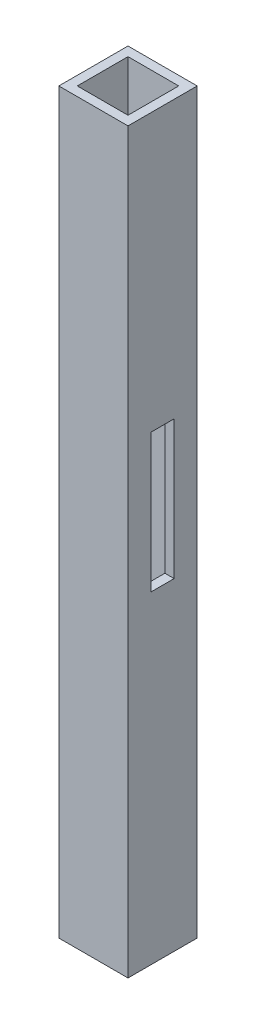
ISO-10303-21;
HEADER;
FILE_DESCRIPTION(('STEP AP214'),'2;1');
FILE_NAME('part.step','',(''),(''),'','','');
FILE_SCHEMA(('AUTOMOTIVE_DESIGN { 1 0 10303 214 1 1 1 1 }'));
ENDSEC;
DATA;
#1=APPLICATION_CONTEXT('core data for automotive mechanical design processes');
#2=APPLICATION_PROTOCOL_DEFINITION('international standard','automotive_design',2000,#1);
#3=PRODUCT_CONTEXT('',#1,'mechanical');
#4=PRODUCT('Part','Part','',(#3));
#5=PRODUCT_RELATED_PRODUCT_CATEGORY('part','',(#4));
#6=PRODUCT_DEFINITION_FORMATION('','',#4);
#7=PRODUCT_DEFINITION_CONTEXT('part definition',#1,'design');
#8=PRODUCT_DEFINITION('design','',#6,#7);
#9=PRODUCT_DEFINITION_SHAPE('','',#8);
#10=(LENGTH_UNIT() NAMED_UNIT(*) SI_UNIT(.MILLI.,.METRE.));
#11=(NAMED_UNIT(*) PLANE_ANGLE_UNIT() SI_UNIT($,.RADIAN.));
#12=(NAMED_UNIT(*) SI_UNIT($,.STERADIAN.) SOLID_ANGLE_UNIT());
#13=UNCERTAINTY_MEASURE_WITH_UNIT(LENGTH_MEASURE(1.E-05),#10,'distance_accuracy_value','');
#14=(GEOMETRIC_REPRESENTATION_CONTEXT(3) GLOBAL_UNCERTAINTY_ASSIGNED_CONTEXT((#13)) GLOBAL_UNIT_ASSIGNED_CONTEXT((#10,
#11,#12)) REPRESENTATION_CONTEXT('',''));
#15=CARTESIAN_POINT('',(0.,0.,0.));
#16=DIRECTION('',(0.,0.,1.));
#17=DIRECTION('',(1.,0.,0.));
#18=AXIS2_PLACEMENT_3D('',#15,#16,#17);
#19=CARTESIAN_POINT('',(0.,160.,0.));
#20=DIRECTION('',(0.,1.,0.));
#21=DIRECTION('',(0.,0.,1.));
#22=AXIS2_PLACEMENT_3D('',#19,#20,#21);
#23=PLANE('',#22);
#24=DIRECTION('',(0.,0.,1.));
#25=VECTOR('',#24,1.);
#26=CARTESIAN_POINT('',(0.,160.,0.));
#27=LINE('',#26,#25);
#28=CARTESIAN_POINT('',(0.,160.,-15.));
#29=VERTEX_POINT('',#28);
#30=CARTESIAN_POINT('',(0.,160.,0.));
#31=VERTEX_POINT('',#30);
#32=EDGE_CURVE('E255',#29,#31,#27,.T.);
#33=ORIENTED_EDGE('',*,*,#32,.T.);
#34=DIRECTION('',(1.,0.,0.));
#35=VECTOR('',#34,1.);
#36=CARTESIAN_POINT('',(0.,160.,0.));
#37=LINE('',#36,#35);
#38=CARTESIAN_POINT('',(15.,160.,0.));
#39=VERTEX_POINT('',#38);
#40=EDGE_CURVE('E258',#31,#39,#37,.T.);
#41=ORIENTED_EDGE('',*,*,#40,.T.);
#42=DIRECTION('',(0.,0.,-1.));
#43=VECTOR('',#42,1.);
#44=CARTESIAN_POINT('',(15.,160.,0.));
#45=LINE('',#44,#43);
#46=CARTESIAN_POINT('',(15.,160.,-15.));
#47=VERTEX_POINT('',#46);
#48=EDGE_CURVE('E261',#39,#47,#45,.T.);
#49=ORIENTED_EDGE('',*,*,#48,.T.);
#50=DIRECTION('',(-1.,0.,0.));
#51=VECTOR('',#50,1.);
#52=CARTESIAN_POINT('',(0.,160.,-15.));
#53=LINE('',#52,#51);
#54=EDGE_CURVE('E263',#47,#29,#53,.T.);
#55=ORIENTED_EDGE('',*,*,#54,.T.);
#56=EDGE_LOOP('',(#33,#41,#49,#55));
#57=FACE_BOUND('',#56,.T.);
#58=DIRECTION('',(1.,0.,0.));
#59=VECTOR('',#58,1.);
#60=CARTESIAN_POINT('',(0.,160.,-2.));
#61=LINE('',#60,#59);
#62=CARTESIAN_POINT('',(2.,160.,-2.));
#63=VERTEX_POINT('',#62);
#64=CARTESIAN_POINT('',(13.,160.,-2.));
#65=VERTEX_POINT('',#64);
#66=EDGE_CURVE('E226',#63,#65,#61,.T.);
#67=ORIENTED_EDGE('',*,*,#66,.F.);
#68=DIRECTION('',(0.,0.,1.));
#69=VECTOR('',#68,1.);
#70=CARTESIAN_POINT('',(2.,160.,0.));
#71=LINE('',#70,#69);
#72=CARTESIAN_POINT('',(2.,160.,-13.));
#73=VERTEX_POINT('',#72);
#74=EDGE_CURVE('E224',#73,#63,#71,.T.);
#75=ORIENTED_EDGE('',*,*,#74,.F.);
#76=DIRECTION('',(-1.,0.,0.));
#77=VECTOR('',#76,1.);
#78=CARTESIAN_POINT('',(0.,160.,-13.));
#79=LINE('',#78,#77);
#80=CARTESIAN_POINT('',(13.,160.,-13.));
#81=VERTEX_POINT('',#80);
#82=EDGE_CURVE('E232',#81,#73,#79,.T.);
#83=ORIENTED_EDGE('',*,*,#82,.F.);
#84=DIRECTION('',(0.,0.,-1.));
#85=VECTOR('',#84,1.);
#86=CARTESIAN_POINT('',(13.,160.,0.));
#87=LINE('',#86,#85);
#88=EDGE_CURVE('E229',#65,#81,#87,.T.);
#89=ORIENTED_EDGE('',*,*,#88,.F.);
#90=EDGE_LOOP('',(#67,#75,#83,#89));
#91=FACE_BOUND('',#90,.T.);
#92=ADVANCED_FACE('F57',(#57,#91),#23,.T.);
#93=CARTESIAN_POINT('',(0.,0.,0.));
#94=DIRECTION('',(0.,1.,0.));
#95=DIRECTION('',(0.,0.,1.));
#96=AXIS2_PLACEMENT_3D('',#93,#94,#95);
#97=PLANE('',#96);
#98=DIRECTION('',(0.,0.,1.));
#99=VECTOR('',#98,1.);
#100=CARTESIAN_POINT('',(0.,0.,0.));
#101=LINE('',#100,#99);
#102=CARTESIAN_POINT('',(0.,0.,-15.));
#103=VERTEX_POINT('',#102);
#104=CARTESIAN_POINT('',(0.,0.,0.));
#105=VERTEX_POINT('',#104);
#106=EDGE_CURVE('E254',#103,#105,#101,.T.);
#107=ORIENTED_EDGE('',*,*,#106,.F.);
#108=DIRECTION('',(-1.,0.,0.));
#109=VECTOR('',#108,1.);
#110=CARTESIAN_POINT('',(0.,0.,-15.));
#111=LINE('',#110,#109);
#112=CARTESIAN_POINT('',(15.,0.,-15.));
#113=VERTEX_POINT('',#112);
#114=EDGE_CURVE('E259',#113,#103,#111,.T.);
#115=ORIENTED_EDGE('',*,*,#114,.F.);
#116=DIRECTION('',(0.,0.,-1.));
#117=VECTOR('',#116,1.);
#118=CARTESIAN_POINT('',(15.,0.,0.));
#119=LINE('',#118,#117);
#120=CARTESIAN_POINT('',(15.,0.,0.));
#121=VERTEX_POINT('',#120);
#122=EDGE_CURVE('E270',#121,#113,#119,.T.);
#123=ORIENTED_EDGE('',*,*,#122,.F.);
#124=DIRECTION('',(1.,0.,0.));
#125=VECTOR('',#124,1.);
#126=CARTESIAN_POINT('',(0.,0.,0.));
#127=LINE('',#126,#125);
#128=EDGE_CURVE('E268',#105,#121,#127,.T.);
#129=ORIENTED_EDGE('',*,*,#128,.F.);
#130=EDGE_LOOP('',(#107,#115,#123,#129));
#131=FACE_BOUND('',#130,.T.);
#132=DIRECTION('',(0.,0.,1.));
#133=VECTOR('',#132,1.);
#134=CARTESIAN_POINT('',(2.,0.,0.));
#135=LINE('',#134,#133);
#136=CARTESIAN_POINT('',(2.,0.,-13.));
#137=VERTEX_POINT('',#136);
#138=CARTESIAN_POINT('',(2.,0.,-2.));
#139=VERTEX_POINT('',#138);
#140=EDGE_CURVE('E223',#137,#139,#135,.T.);
#141=ORIENTED_EDGE('',*,*,#140,.T.);
#142=DIRECTION('',(1.,0.,0.));
#143=VECTOR('',#142,1.);
#144=CARTESIAN_POINT('',(0.,0.,-2.));
#145=LINE('',#144,#143);
#146=CARTESIAN_POINT('',(13.,0.,-2.));
#147=VERTEX_POINT('',#146);
#148=EDGE_CURVE('E237',#139,#147,#145,.T.);
#149=ORIENTED_EDGE('',*,*,#148,.T.);
#150=DIRECTION('',(0.,0.,-1.));
#151=VECTOR('',#150,1.);
#152=CARTESIAN_POINT('',(13.,0.,0.));
#153=LINE('',#152,#151);
#154=CARTESIAN_POINT('',(13.,0.,-13.));
#155=VERTEX_POINT('',#154);
#156=EDGE_CURVE('E240',#147,#155,#153,.T.);
#157=ORIENTED_EDGE('',*,*,#156,.T.);
#158=DIRECTION('',(-1.,0.,0.));
#159=VECTOR('',#158,1.);
#160=CARTESIAN_POINT('',(0.,0.,-13.));
#161=LINE('',#160,#159);
#162=EDGE_CURVE('E227',#155,#137,#161,.T.);
#163=ORIENTED_EDGE('',*,*,#162,.T.);
#164=EDGE_LOOP('',(#141,#149,#157,#163));
#165=FACE_BOUND('',#164,.T.);
#166=ADVANCED_FACE('F324',(#131,#165),#97,.F.);
#167=CARTESIAN_POINT('',(0.,160.,0.));
#168=DIRECTION('',(1.,0.,0.));
#169=DIRECTION('',(0.,0.,-1.));
#170=AXIS2_PLACEMENT_3D('',#167,#168,#169);
#171=PLANE('',#170);
#172=DIRECTION('',(0.,0.,1.));
#173=VECTOR('',#172,1.);
#174=CARTESIAN_POINT('',(0.,100.,-5.));
#175=LINE('',#174,#173);
#176=CARTESIAN_POINT('',(0.,100.,-10.));
#177=VERTEX_POINT('',#176);
#178=CARTESIAN_POINT('',(0.,100.,-5.));
#179=VERTEX_POINT('',#178);
#180=EDGE_CURVE('E193',#177,#179,#175,.T.);
#181=ORIENTED_EDGE('',*,*,#180,.T.);
#182=DIRECTION('',(0.,-1.,0.));
#183=VECTOR('',#182,1.);
#184=CARTESIAN_POINT('',(0.,100.,-5.));
#185=LINE('',#184,#183);
#186=CARTESIAN_POINT('',(0.,70.,-5.));
#187=VERTEX_POINT('',#186);
#188=EDGE_CURVE('E176',#179,#187,#185,.T.);
#189=ORIENTED_EDGE('',*,*,#188,.T.);
#190=DIRECTION('',(0.,0.,-1.));
#191=VECTOR('',#190,1.);
#192=CARTESIAN_POINT('',(0.,70.,-5.));
#193=LINE('',#192,#191);
#194=CARTESIAN_POINT('',(0.,70.,-10.));
#195=VERTEX_POINT('',#194);
#196=EDGE_CURVE('E186',#187,#195,#193,.T.);
#197=ORIENTED_EDGE('',*,*,#196,.T.);
#198=DIRECTION('',(0.,1.,0.));
#199=VECTOR('',#198,1.);
#200=CARTESIAN_POINT('',(0.,100.,-10.));
#201=LINE('',#200,#199);
#202=EDGE_CURVE('E72',#195,#177,#201,.T.);
#203=ORIENTED_EDGE('',*,*,#202,.T.);
#204=EDGE_LOOP('',(#181,#189,#197,#203));
#205=FACE_BOUND('',#204,.T.);
#206=ORIENTED_EDGE('',*,*,#106,.T.);
#207=DIRECTION('',(0.,-1.,0.));
#208=VECTOR('',#207,1.);
#209=CARTESIAN_POINT('',(0.,160.,0.));
#210=LINE('',#209,#208);
#211=EDGE_CURVE('E281',#31,#105,#210,.T.);
#212=ORIENTED_EDGE('',*,*,#211,.F.);
#213=ORIENTED_EDGE('',*,*,#32,.F.);
#214=DIRECTION('',(0.,-1.,0.));
#215=VECTOR('',#214,1.);
#216=CARTESIAN_POINT('',(0.,160.,-15.));
#217=LINE('',#216,#215);
#218=EDGE_CURVE('E265',#29,#103,#217,.T.);
#219=ORIENTED_EDGE('',*,*,#218,.T.);
#220=EDGE_LOOP('',(#206,#212,#213,#219));
#221=FACE_BOUND('',#220,.T.);
#222=ADVANCED_FACE('F59',(#205,#221),#171,.F.);
#223=CARTESIAN_POINT('',(0.,160.,0.));
#224=DIRECTION('',(0.,0.,-1.));
#225=DIRECTION('',(-1.,0.,0.));
#226=AXIS2_PLACEMENT_3D('',#223,#224,#225);
#227=PLANE('',#226);
#228=ORIENTED_EDGE('',*,*,#128,.T.);
#229=DIRECTION('',(0.,-1.,0.));
#230=VECTOR('',#229,1.);
#231=CARTESIAN_POINT('',(15.,160.,0.));
#232=LINE('',#231,#230);
#233=EDGE_CURVE('E278',#39,#121,#232,.T.);
#234=ORIENTED_EDGE('',*,*,#233,.F.);
#235=ORIENTED_EDGE('',*,*,#40,.F.);
#236=ORIENTED_EDGE('',*,*,#211,.T.);
#237=EDGE_LOOP('',(#228,#234,#235,#236));
#238=FACE_BOUND('',#237,.T.);
#239=ADVANCED_FACE('F312',(#238),#227,.F.);
#240=CARTESIAN_POINT('',(15.,160.,0.));
#241=DIRECTION('',(-1.,0.,0.));
#242=DIRECTION('',(0.,0.,1.));
#243=AXIS2_PLACEMENT_3D('',#240,#241,#242);
#244=PLANE('',#243);
#245=DIRECTION('',(0.,0.,-1.));
#246=VECTOR('',#245,1.);
#247=CARTESIAN_POINT('',(15.,70.,-5.));
#248=LINE('',#247,#246);
#249=CARTESIAN_POINT('',(15.,70.,-5.));
#250=VERTEX_POINT('',#249);
#251=CARTESIAN_POINT('',(15.,70.,-10.));
#252=VERTEX_POINT('',#251);
#253=EDGE_CURVE('E203',#250,#252,#248,.T.);
#254=ORIENTED_EDGE('',*,*,#253,.F.);
#255=DIRECTION('',(0.,-1.,0.));
#256=VECTOR('',#255,1.);
#257=CARTESIAN_POINT('',(15.,100.,-5.));
#258=LINE('',#257,#256);
#259=CARTESIAN_POINT('',(15.,100.,-5.));
#260=VERTEX_POINT('',#259);
#261=EDGE_CURVE('E80',#260,#250,#258,.T.);
#262=ORIENTED_EDGE('',*,*,#261,.F.);
#263=DIRECTION('',(0.,0.,1.));
#264=VECTOR('',#263,1.);
#265=CARTESIAN_POINT('',(15.,100.,-5.));
#266=LINE('',#265,#264);
#267=CARTESIAN_POINT('',(15.,100.,-10.));
#268=VERTEX_POINT('',#267);
#269=EDGE_CURVE('E194',#268,#260,#266,.T.);
#270=ORIENTED_EDGE('',*,*,#269,.F.);
#271=DIRECTION('',(0.,1.,0.));
#272=VECTOR('',#271,1.);
#273=CARTESIAN_POINT('',(15.,100.,-10.));
#274=LINE('',#273,#272);
#275=EDGE_CURVE('E197',#252,#268,#274,.T.);
#276=ORIENTED_EDGE('',*,*,#275,.F.);
#277=EDGE_LOOP('',(#254,#262,#270,#276));
#278=FACE_BOUND('',#277,.T.);
#279=ORIENTED_EDGE('',*,*,#122,.T.);
#280=DIRECTION('',(0.,-1.,0.));
#281=VECTOR('',#280,1.);
#282=CARTESIAN_POINT('',(15.,160.,-15.));
#283=LINE('',#282,#281);
#284=EDGE_CURVE('E275',#47,#113,#283,.T.);
#285=ORIENTED_EDGE('',*,*,#284,.F.);
#286=ORIENTED_EDGE('',*,*,#48,.F.);
#287=ORIENTED_EDGE('',*,*,#233,.T.);
#288=EDGE_LOOP('',(#279,#285,#286,#287));
#289=FACE_BOUND('',#288,.T.);
#290=ADVANCED_FACE('F308',(#278,#289),#244,.F.);
#291=CARTESIAN_POINT('',(0.,160.,-15.));
#292=DIRECTION('',(0.,0.,1.));
#293=DIRECTION('',(1.,0.,0.));
#294=AXIS2_PLACEMENT_3D('',#291,#292,#293);
#295=PLANE('',#294);
#296=ORIENTED_EDGE('',*,*,#114,.T.);
#297=ORIENTED_EDGE('',*,*,#218,.F.);
#298=ORIENTED_EDGE('',*,*,#54,.F.);
#299=ORIENTED_EDGE('',*,*,#284,.T.);
#300=EDGE_LOOP('',(#296,#297,#298,#299));
#301=FACE_BOUND('',#300,.T.);
#302=ADVANCED_FACE('F311',(#301),#295,.F.);
#303=CARTESIAN_POINT('',(2.,160.,0.));
#304=DIRECTION('',(1.,0.,0.));
#305=DIRECTION('',(0.,0.,-1.));
#306=AXIS2_PLACEMENT_3D('',#303,#304,#305);
#307=PLANE('',#306);
#308=DIRECTION('',(0.,-1.,0.));
#309=VECTOR('',#308,1.);
#310=CARTESIAN_POINT('',(2.,160.,-5.00000000000001));
#311=LINE('',#310,#309);
#312=CARTESIAN_POINT('',(2.,100.,-5.));
#313=VERTEX_POINT('',#312);
#314=CARTESIAN_POINT('',(2.,70.,-5.));
#315=VERTEX_POINT('',#314);
#316=EDGE_CURVE('E179',#313,#315,#311,.T.);
#317=ORIENTED_EDGE('',*,*,#316,.F.);
#318=DIRECTION('',(0.,0.,1.));
#319=VECTOR('',#318,1.);
#320=CARTESIAN_POINT('',(2.,100.,0.));
#321=LINE('',#320,#319);
#322=CARTESIAN_POINT('',(2.,100.,-10.));
#323=VERTEX_POINT('',#322);
#324=EDGE_CURVE('E220',#323,#313,#321,.T.);
#325=ORIENTED_EDGE('',*,*,#324,.F.);
#326=DIRECTION('',(0.,1.,0.));
#327=VECTOR('',#326,1.);
#328=CARTESIAN_POINT('',(2.,160.,-9.99999999999999));
#329=LINE('',#328,#327);
#330=CARTESIAN_POINT('',(2.,70.,-10.));
#331=VERTEX_POINT('',#330);
#332=EDGE_CURVE('E218',#331,#323,#329,.T.);
#333=ORIENTED_EDGE('',*,*,#332,.F.);
#334=DIRECTION('',(0.,0.,-1.));
#335=VECTOR('',#334,1.);
#336=CARTESIAN_POINT('',(2.,70.,0.));
#337=LINE('',#336,#335);
#338=EDGE_CURVE('E210',#315,#331,#337,.T.);
#339=ORIENTED_EDGE('',*,*,#338,.F.);
#340=EDGE_LOOP('',(#317,#325,#333,#339));
#341=FACE_BOUND('',#340,.T.);
#342=ORIENTED_EDGE('',*,*,#140,.F.);
#343=DIRECTION('',(0.,-1.,0.));
#344=VECTOR('',#343,1.);
#345=CARTESIAN_POINT('',(2.,160.,-13.));
#346=LINE('',#345,#344);
#347=EDGE_CURVE('E234',#73,#137,#346,.T.);
#348=ORIENTED_EDGE('',*,*,#347,.F.);
#349=ORIENTED_EDGE('',*,*,#74,.T.);
#350=DIRECTION('',(0.,-1.,0.));
#351=VECTOR('',#350,1.);
#352=CARTESIAN_POINT('',(2.,160.,-2.));
#353=LINE('',#352,#351);
#354=EDGE_CURVE('E251',#63,#139,#353,.T.);
#355=ORIENTED_EDGE('',*,*,#354,.T.);
#356=EDGE_LOOP('',(#342,#348,#349,#355));
#357=FACE_BOUND('',#356,.T.);
#358=ADVANCED_FACE('F342',(#341,#357),#307,.T.);
#359=CARTESIAN_POINT('',(0.,160.,-2.));
#360=DIRECTION('',(0.,0.,-1.));
#361=DIRECTION('',(-1.,0.,0.));
#362=AXIS2_PLACEMENT_3D('',#359,#360,#361);
#363=PLANE('',#362);
#364=ORIENTED_EDGE('',*,*,#148,.F.);
#365=ORIENTED_EDGE('',*,*,#354,.F.);
#366=ORIENTED_EDGE('',*,*,#66,.T.);
#367=DIRECTION('',(0.,-1.,0.));
#368=VECTOR('',#367,1.);
#369=CARTESIAN_POINT('',(13.,160.,-2.));
#370=LINE('',#369,#368);
#371=EDGE_CURVE('E249',#65,#147,#370,.T.);
#372=ORIENTED_EDGE('',*,*,#371,.T.);
#373=EDGE_LOOP('',(#364,#365,#366,#372));
#374=FACE_BOUND('',#373,.T.);
#375=ADVANCED_FACE('F349',(#374),#363,.T.);
#376=CARTESIAN_POINT('',(13.,160.,0.));
#377=DIRECTION('',(-1.,0.,0.));
#378=DIRECTION('',(0.,0.,1.));
#379=AXIS2_PLACEMENT_3D('',#376,#377,#378);
#380=PLANE('',#379);
#381=DIRECTION('',(0.,1.,0.));
#382=VECTOR('',#381,1.);
#383=CARTESIAN_POINT('',(13.,160.,-5.00000000000001));
#384=LINE('',#383,#382);
#385=CARTESIAN_POINT('',(13.,70.,-5.));
#386=VERTEX_POINT('',#385);
#387=CARTESIAN_POINT('',(13.,100.,-5.));
#388=VERTEX_POINT('',#387);
#389=EDGE_CURVE('E12',#386,#388,#384,.T.);
#390=ORIENTED_EDGE('',*,*,#389,.F.);
#391=DIRECTION('',(0.,0.,1.));
#392=VECTOR('',#391,1.);
#393=CARTESIAN_POINT('',(13.,70.,0.));
#394=LINE('',#393,#392);
#395=CARTESIAN_POINT('',(13.,70.,-10.));
#396=VERTEX_POINT('',#395);
#397=EDGE_CURVE('E284',#396,#386,#394,.T.);
#398=ORIENTED_EDGE('',*,*,#397,.F.);
#399=DIRECTION('',(0.,-1.,0.));
#400=VECTOR('',#399,1.);
#401=CARTESIAN_POINT('',(13.,160.,-9.99999999999999));
#402=LINE('',#401,#400);
#403=CARTESIAN_POINT('',(13.,100.,-10.));
#404=VERTEX_POINT('',#403);
#405=EDGE_CURVE('E286',#404,#396,#402,.T.);
#406=ORIENTED_EDGE('',*,*,#405,.F.);
#407=DIRECTION('',(0.,0.,-1.));
#408=VECTOR('',#407,1.);
#409=CARTESIAN_POINT('',(13.,100.,0.));
#410=LINE('',#409,#408);
#411=EDGE_CURVE('E65',#388,#404,#410,.T.);
#412=ORIENTED_EDGE('',*,*,#411,.F.);
#413=EDGE_LOOP('',(#390,#398,#406,#412));
#414=FACE_BOUND('',#413,.T.);
#415=ORIENTED_EDGE('',*,*,#156,.F.);
#416=ORIENTED_EDGE('',*,*,#371,.F.);
#417=ORIENTED_EDGE('',*,*,#88,.T.);
#418=DIRECTION('',(0.,-1.,0.));
#419=VECTOR('',#418,1.);
#420=CARTESIAN_POINT('',(13.,160.,-13.));
#421=LINE('',#420,#419);
#422=EDGE_CURVE('E247',#81,#155,#421,.T.);
#423=ORIENTED_EDGE('',*,*,#422,.T.);
#424=EDGE_LOOP('',(#415,#416,#417,#423));
#425=FACE_BOUND('',#424,.T.);
#426=ADVANCED_FACE('F301',(#414,#425),#380,.T.);
#427=CARTESIAN_POINT('',(0.,160.,-13.));
#428=DIRECTION('',(0.,0.,1.));
#429=DIRECTION('',(1.,0.,0.));
#430=AXIS2_PLACEMENT_3D('',#427,#428,#429);
#431=PLANE('',#430);
#432=ORIENTED_EDGE('',*,*,#162,.F.);
#433=ORIENTED_EDGE('',*,*,#422,.F.);
#434=ORIENTED_EDGE('',*,*,#82,.T.);
#435=ORIENTED_EDGE('',*,*,#347,.T.);
#436=EDGE_LOOP('',(#432,#433,#434,#435));
#437=FACE_BOUND('',#436,.T.);
#438=ADVANCED_FACE('F362',(#437),#431,.T.);
#439=CARTESIAN_POINT('',(0.,70.,-5.));
#440=DIRECTION('',(0.,-1.,0.));
#441=DIRECTION('',(0.,0.,-1.));
#442=AXIS2_PLACEMENT_3D('',#439,#440,#441);
#443=PLANE('',#442);
#444=ORIENTED_EDGE('',*,*,#397,.T.);
#445=DIRECTION('',(1.,0.,0.));
#446=VECTOR('',#445,1.);
#447=CARTESIAN_POINT('',(0.,70.,-5.));
#448=LINE('',#447,#446);
#449=EDGE_CURVE('E183',#386,#250,#448,.T.);
#450=ORIENTED_EDGE('',*,*,#449,.T.);
#451=ORIENTED_EDGE('',*,*,#253,.T.);
#452=DIRECTION('',(1.,0.,0.));
#453=VECTOR('',#452,1.);
#454=CARTESIAN_POINT('',(0.,70.,-10.));
#455=LINE('',#454,#453);
#456=EDGE_CURVE('E182',#396,#252,#455,.T.);
#457=ORIENTED_EDGE('',*,*,#456,.F.);
#458=EDGE_LOOP('',(#444,#450,#451,#457));
#459=FACE_BOUND('',#458,.T.);
#460=ADVANCED_FACE('F304',(#459),#443,.F.);
#461=CARTESIAN_POINT('',(0.,100.,-10.));
#462=DIRECTION('',(0.,0.,-1.));
#463=DIRECTION('',(0.,1.,0.));
#464=AXIS2_PLACEMENT_3D('',#461,#462,#463);
#465=PLANE('',#464);
#466=ORIENTED_EDGE('',*,*,#405,.T.);
#467=ORIENTED_EDGE('',*,*,#456,.T.);
#468=ORIENTED_EDGE('',*,*,#275,.T.);
#469=DIRECTION('',(1.,0.,0.));
#470=VECTOR('',#469,1.);
#471=CARTESIAN_POINT('',(0.,100.,-10.));
#472=LINE('',#471,#470);
#473=EDGE_CURVE('E215',#404,#268,#472,.T.);
#474=ORIENTED_EDGE('',*,*,#473,.F.);
#475=EDGE_LOOP('',(#466,#467,#468,#474));
#476=FACE_BOUND('',#475,.T.);
#477=ADVANCED_FACE('F297',(#476),#465,.F.);
#478=CARTESIAN_POINT('',(0.,100.,-5.));
#479=DIRECTION('',(0.,1.,0.));
#480=DIRECTION('',(0.,0.,1.));
#481=AXIS2_PLACEMENT_3D('',#478,#479,#480);
#482=PLANE('',#481);
#483=ORIENTED_EDGE('',*,*,#411,.T.);
#484=ORIENTED_EDGE('',*,*,#473,.T.);
#485=ORIENTED_EDGE('',*,*,#269,.T.);
#486=DIRECTION('',(1.,0.,0.));
#487=VECTOR('',#486,1.);
#488=CARTESIAN_POINT('',(0.,100.,-5.));
#489=LINE('',#488,#487);
#490=EDGE_CURVE('E211',#388,#260,#489,.T.);
#491=ORIENTED_EDGE('',*,*,#490,.F.);
#492=EDGE_LOOP('',(#483,#484,#485,#491));
#493=FACE_BOUND('',#492,.T.);
#494=ADVANCED_FACE('F292',(#493),#482,.F.);
#495=CARTESIAN_POINT('',(0.,100.,-5.));
#496=DIRECTION('',(0.,0.,1.));
#497=DIRECTION('',(0.,-1.,0.));
#498=AXIS2_PLACEMENT_3D('',#495,#496,#497);
#499=PLANE('',#498);
#500=ORIENTED_EDGE('',*,*,#389,.T.);
#501=ORIENTED_EDGE('',*,*,#490,.T.);
#502=ORIENTED_EDGE('',*,*,#261,.T.);
#503=ORIENTED_EDGE('',*,*,#449,.F.);
#504=EDGE_LOOP('',(#500,#501,#502,#503));
#505=FACE_BOUND('',#504,.T.);
#506=ADVANCED_FACE('F306',(#505),#499,.F.);
#507=ORIENTED_EDGE('',*,*,#316,.T.);
#508=EDGE_CURVE('E171',#187,#315,#448,.T.);
#509=ORIENTED_EDGE('',*,*,#508,.F.);
#510=ORIENTED_EDGE('',*,*,#188,.F.);
#511=EDGE_CURVE('E208',#179,#313,#489,.T.);
#512=ORIENTED_EDGE('',*,*,#511,.T.);
#513=EDGE_LOOP('',(#507,#509,#510,#512));
#514=FACE_BOUND('',#513,.T.);
#515=ADVANCED_FACE('F173',(#514),#499,.F.);
#516=ORIENTED_EDGE('',*,*,#324,.T.);
#517=ORIENTED_EDGE('',*,*,#511,.F.);
#518=ORIENTED_EDGE('',*,*,#180,.F.);
#519=EDGE_CURVE('E212',#177,#323,#472,.T.);
#520=ORIENTED_EDGE('',*,*,#519,.T.);
#521=EDGE_LOOP('',(#516,#517,#518,#520));
#522=FACE_BOUND('',#521,.T.);
#523=ADVANCED_FACE('F383',(#522),#482,.F.);
#524=ORIENTED_EDGE('',*,*,#332,.T.);
#525=ORIENTED_EDGE('',*,*,#519,.F.);
#526=ORIENTED_EDGE('',*,*,#202,.F.);
#527=EDGE_CURVE('E188',#195,#331,#455,.T.);
#528=ORIENTED_EDGE('',*,*,#527,.T.);
#529=EDGE_LOOP('',(#524,#525,#526,#528));
#530=FACE_BOUND('',#529,.T.);
#531=ADVANCED_FACE('F381',(#530),#465,.F.);
#532=ORIENTED_EDGE('',*,*,#338,.T.);
#533=ORIENTED_EDGE('',*,*,#527,.F.);
#534=ORIENTED_EDGE('',*,*,#196,.F.);
#535=ORIENTED_EDGE('',*,*,#508,.T.);
#536=EDGE_LOOP('',(#532,#533,#534,#535));
#537=FACE_BOUND('',#536,.T.);
#538=ADVANCED_FACE('F187',(#537),#443,.F.);
#539=CLOSED_SHELL('',(#92,#166,#222,#239,#290,#302,#358,#375,#426,#438,#460,#477,#494,#506,#515,
#523,#531,#538));
#540=MANIFOLD_SOLID_BREP('B2',#539);
#541=ADVANCED_BREP_SHAPE_REPRESENTATION('',(#18,#540),#14);
#542=SHAPE_DEFINITION_REPRESENTATION(#9,#541);
ENDSEC;
END-ISO-10303-21;
